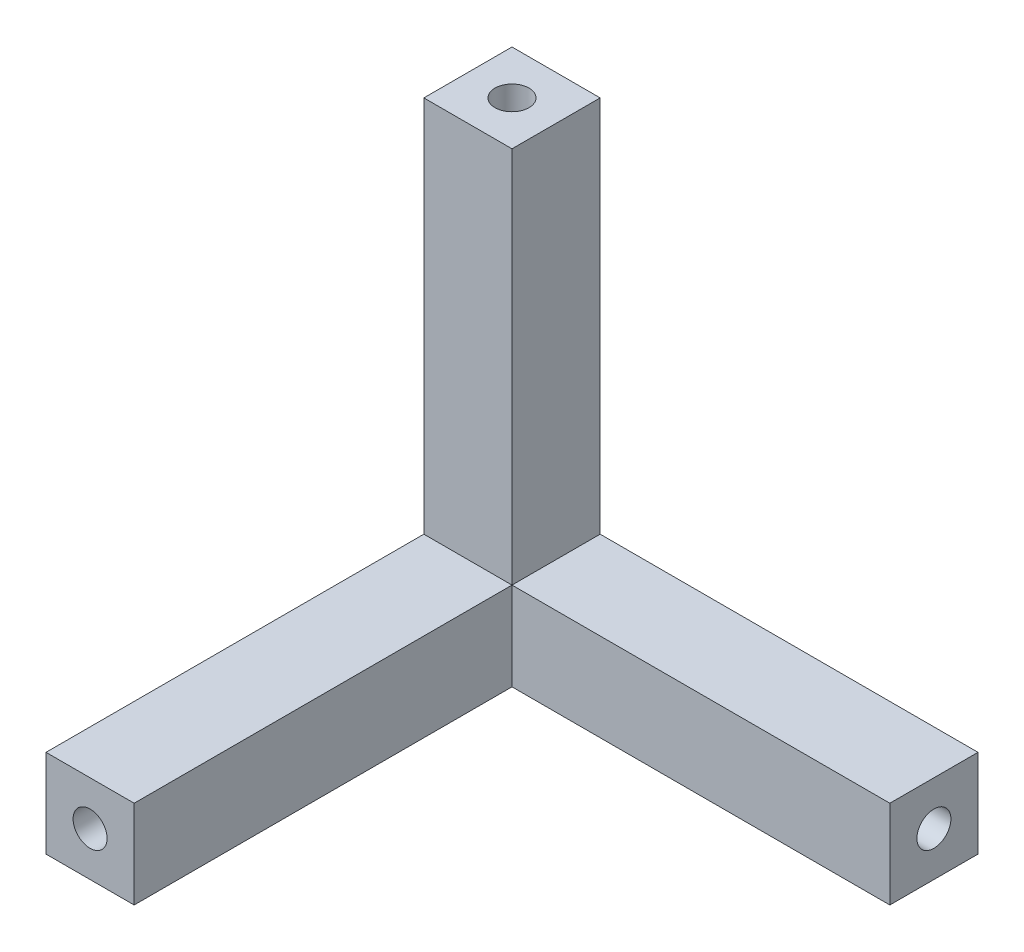
ISO-10303-21;
HEADER;
FILE_DESCRIPTION(('STEP AP214'),'2;1');
FILE_NAME('part.step','',(''),(''),'','','');
FILE_SCHEMA(('AUTOMOTIVE_DESIGN { 1 0 10303 214 1 1 1 1 }'));
ENDSEC;
DATA;
#1=APPLICATION_CONTEXT('core data for automotive mechanical design processes');
#2=APPLICATION_PROTOCOL_DEFINITION('international standard','automotive_design',2000,#1);
#3=PRODUCT_CONTEXT('',#1,'mechanical');
#4=PRODUCT('Part','Part','',(#3));
#5=PRODUCT_RELATED_PRODUCT_CATEGORY('part','',(#4));
#6=PRODUCT_DEFINITION_FORMATION('','',#4);
#7=PRODUCT_DEFINITION_CONTEXT('part definition',#1,'design');
#8=PRODUCT_DEFINITION('design','',#6,#7);
#9=PRODUCT_DEFINITION_SHAPE('','',#8);
#10=(LENGTH_UNIT() NAMED_UNIT(*) SI_UNIT(.MILLI.,.METRE.));
#11=(NAMED_UNIT(*) PLANE_ANGLE_UNIT() SI_UNIT($,.RADIAN.));
#12=(NAMED_UNIT(*) SI_UNIT($,.STERADIAN.) SOLID_ANGLE_UNIT());
#13=UNCERTAINTY_MEASURE_WITH_UNIT(LENGTH_MEASURE(1.E-05),#10,'distance_accuracy_value','');
#14=(GEOMETRIC_REPRESENTATION_CONTEXT(3) GLOBAL_UNCERTAINTY_ASSIGNED_CONTEXT((#13)) GLOBAL_UNIT_ASSIGNED_CONTEXT((#10,
#11,#12)) REPRESENTATION_CONTEXT('',''));
#15=CARTESIAN_POINT('',(0.,0.,0.));
#16=DIRECTION('',(0.,0.,1.));
#17=DIRECTION('',(1.,0.,0.));
#18=AXIS2_PLACEMENT_3D('',#15,#16,#17);
#19=CARTESIAN_POINT('',(0.,1.75,0.));
#20=DIRECTION('',(0.,-1.,0.));
#21=DIRECTION('',(0.,0.,-1.));
#22=AXIS2_PLACEMENT_3D('',#19,#20,#21);
#23=PLANE('',#22);
#24=DIRECTION('',(0.,0.,-1.));
#25=VECTOR('',#24,1.);
#26=CARTESIAN_POINT('',(1.75,1.75,1.75));
#27=LINE('',#26,#25);
#28=CARTESIAN_POINT('',(1.75,1.75,1.75));
#29=VERTEX_POINT('',#28);
#30=CARTESIAN_POINT('',(1.75,1.75,-1.75));
#31=VERTEX_POINT('',#30);
#32=EDGE_CURVE('E143',#29,#31,#27,.T.);
#33=ORIENTED_EDGE('',*,*,#32,.F.);
#34=DIRECTION('',(1.,0.,0.));
#35=VECTOR('',#34,1.);
#36=CARTESIAN_POINT('',(16.75,1.75,1.75));
#37=LINE('',#36,#35);
#38=CARTESIAN_POINT('',(16.75,1.75,1.75));
#39=VERTEX_POINT('',#38);
#40=EDGE_CURVE('E116',#29,#39,#37,.T.);
#41=ORIENTED_EDGE('',*,*,#40,.T.);
#42=DIRECTION('',(0.,0.,-1.));
#43=VECTOR('',#42,1.);
#44=CARTESIAN_POINT('',(16.75,1.75,-1.75));
#45=LINE('',#44,#43);
#46=CARTESIAN_POINT('',(16.75,1.75,-1.75));
#47=VERTEX_POINT('',#46);
#48=EDGE_CURVE('E125',#39,#47,#45,.T.);
#49=ORIENTED_EDGE('',*,*,#48,.T.);
#50=DIRECTION('',(-1.,0.,0.));
#51=VECTOR('',#50,1.);
#52=CARTESIAN_POINT('',(-1.75,1.75,-1.75));
#53=LINE('',#52,#51);
#54=EDGE_CURVE('E69',#47,#31,#53,.T.);
#55=ORIENTED_EDGE('',*,*,#54,.T.);
#56=EDGE_LOOP('',(#33,#41,#49,#55));
#57=FACE_BOUND('',#56,.T.);
#58=ADVANCED_FACE('F45',(#57),#23,.F.);
#59=DIRECTION('',(1.,0.,0.));
#60=VECTOR('',#59,1.);
#61=CARTESIAN_POINT('',(1.75,1.75,1.75));
#62=LINE('',#61,#60);
#63=CARTESIAN_POINT('',(-1.75,1.75,1.75));
#64=VERTEX_POINT('',#63);
#65=EDGE_CURVE('E61',#64,#29,#62,.T.);
#66=ORIENTED_EDGE('',*,*,#65,.F.);
#67=DIRECTION('',(0.,0.,1.));
#68=VECTOR('',#67,1.);
#69=CARTESIAN_POINT('',(-1.75,1.75,-1.75));
#70=LINE('',#69,#68);
#71=CARTESIAN_POINT('',(-1.75,1.75,16.75));
#72=VERTEX_POINT('',#71);
#73=EDGE_CURVE('E202',#64,#72,#70,.T.);
#74=ORIENTED_EDGE('',*,*,#73,.T.);
#75=DIRECTION('',(1.,0.,0.));
#76=VECTOR('',#75,1.);
#77=CARTESIAN_POINT('',(1.75,1.75,16.75));
#78=LINE('',#77,#76);
#79=CARTESIAN_POINT('',(1.75,1.75,16.75));
#80=VERTEX_POINT('',#79);
#81=EDGE_CURVE('E139',#72,#80,#78,.T.);
#82=ORIENTED_EDGE('',*,*,#81,.T.);
#83=DIRECTION('',(0.,0.,-1.));
#84=VECTOR('',#83,1.);
#85=CARTESIAN_POINT('',(1.75,1.75,1.75));
#86=LINE('',#85,#84);
#87=EDGE_CURVE('E126',#80,#29,#86,.T.);
#88=ORIENTED_EDGE('',*,*,#87,.T.);
#89=EDGE_LOOP('',(#66,#74,#82,#88));
#90=FACE_BOUND('',#89,.T.);
#91=ADVANCED_FACE('F137',(#90),#23,.F.);
#92=CARTESIAN_POINT('',(-1.75,1.75,-1.75));
#93=DIRECTION('',(0.,0.,1.));
#94=DIRECTION('',(1.,0.,0.));
#95=AXIS2_PLACEMENT_3D('',#92,#93,#94);
#96=PLANE('',#95);
#97=DIRECTION('',(-1.,0.,0.));
#98=VECTOR('',#97,1.);
#99=CARTESIAN_POINT('',(-1.75,-1.75,-1.75));
#100=LINE('',#99,#98);
#101=CARTESIAN_POINT('',(16.75,-1.75,-1.75));
#102=VERTEX_POINT('',#101);
#103=CARTESIAN_POINT('',(-1.75,-1.75,-1.75));
#104=VERTEX_POINT('',#103);
#105=EDGE_CURVE('E196',#102,#104,#100,.T.);
#106=ORIENTED_EDGE('',*,*,#105,.T.);
#107=DIRECTION('',(0.,-1.,0.));
#108=VECTOR('',#107,1.);
#109=CARTESIAN_POINT('',(-1.75,1.75,-1.75));
#110=LINE('',#109,#108);
#111=CARTESIAN_POINT('',(-1.75000000000004,16.75,-1.75000000000004));
#112=VERTEX_POINT('',#111);
#113=EDGE_CURVE('E12',#112,#104,#110,.T.);
#114=ORIENTED_EDGE('',*,*,#113,.F.);
#115=DIRECTION('',(-1.,0.,0.));
#116=VECTOR('',#115,1.);
#117=CARTESIAN_POINT('',(1.74999999999996,16.75,-1.75000000000004));
#118=LINE('',#117,#116);
#119=CARTESIAN_POINT('',(1.74999999999996,16.75,-1.75000000000004));
#120=VERTEX_POINT('',#119);
#121=EDGE_CURVE('E171',#120,#112,#118,.T.);
#122=ORIENTED_EDGE('',*,*,#121,.F.);
#123=DIRECTION('',(0.,1.,0.));
#124=VECTOR('',#123,1.);
#125=CARTESIAN_POINT('',(1.75,1.75,-1.75));
#126=LINE('',#125,#124);
#127=EDGE_CURVE('E167',#31,#120,#126,.T.);
#128=ORIENTED_EDGE('',*,*,#127,.F.);
#129=ORIENTED_EDGE('',*,*,#54,.F.);
#130=DIRECTION('',(0.,-1.,0.));
#131=VECTOR('',#130,1.);
#132=CARTESIAN_POINT('',(16.75,1.75,-1.75));
#133=LINE('',#132,#131);
#134=EDGE_CURVE('E210',#47,#102,#133,.T.);
#135=ORIENTED_EDGE('',*,*,#134,.T.);
#136=EDGE_LOOP('',(#106,#114,#122,#128,#129,#135));
#137=FACE_BOUND('',#136,.T.);
#138=ADVANCED_FACE('F47',(#137),#96,.F.);
#139=CARTESIAN_POINT('',(-1.75,1.75,-1.75));
#140=DIRECTION('',(1.,0.,0.));
#141=DIRECTION('',(0.,0.,-1.));
#142=AXIS2_PLACEMENT_3D('',#139,#140,#141);
#143=PLANE('',#142);
#144=DIRECTION('',(0.,0.,1.));
#145=VECTOR('',#144,1.);
#146=CARTESIAN_POINT('',(-1.75,-1.75,-1.75));
#147=LINE('',#146,#145);
#148=CARTESIAN_POINT('',(-1.75,-1.75,16.75));
#149=VERTEX_POINT('',#148);
#150=EDGE_CURVE('E214',#104,#149,#147,.T.);
#151=ORIENTED_EDGE('',*,*,#150,.T.);
#152=DIRECTION('',(0.,-1.,0.));
#153=VECTOR('',#152,1.);
#154=CARTESIAN_POINT('',(-1.75,1.75,16.75));
#155=LINE('',#154,#153);
#156=EDGE_CURVE('E54',#72,#149,#155,.T.);
#157=ORIENTED_EDGE('',*,*,#156,.F.);
#158=ORIENTED_EDGE('',*,*,#73,.F.);
#159=DIRECTION('',(0.,1.,0.));
#160=VECTOR('',#159,1.);
#161=CARTESIAN_POINT('',(-1.75,1.75,1.75));
#162=LINE('',#161,#160);
#163=CARTESIAN_POINT('',(-1.75000000000004,16.75,1.74999999999996));
#164=VERTEX_POINT('',#163);
#165=EDGE_CURVE('E158',#64,#164,#162,.T.);
#166=ORIENTED_EDGE('',*,*,#165,.T.);
#167=DIRECTION('',(0.,0.,1.));
#168=VECTOR('',#167,1.);
#169=CARTESIAN_POINT('',(-1.75000000000004,16.75,1.74999999999996));
#170=LINE('',#169,#168);
#171=EDGE_CURVE('E175',#112,#164,#170,.T.);
#172=ORIENTED_EDGE('',*,*,#171,.F.);
#173=ORIENTED_EDGE('',*,*,#113,.T.);
#174=EDGE_LOOP('',(#151,#157,#158,#166,#172,#173));
#175=FACE_BOUND('',#174,.T.);
#176=ADVANCED_FACE('F253',(#175),#143,.F.);
#177=CARTESIAN_POINT('',(1.75,1.75,16.75));
#178=DIRECTION('',(0.,0.,-1.));
#179=DIRECTION('',(-1.,0.,0.));
#180=AXIS2_PLACEMENT_3D('',#177,#178,#179);
#181=PLANE('',#180);
#182=CARTESIAN_POINT('',(0.,0.,16.75));
#183=DIRECTION('',(0.,0.,1.));
#184=DIRECTION('',(1.,0.,0.));
#185=AXIS2_PLACEMENT_3D('',#182,#183,#184);
#186=CIRCLE('',#185,0.675);
#187=CARTESIAN_POINT('',(0.675,0.,16.75));
#188=VERTEX_POINT('',#187);
#189=EDGE_CURVE('E188',#188,#188,#186,.T.);
#190=ORIENTED_EDGE('',*,*,#189,.F.);
#191=EDGE_LOOP('',(#190));
#192=FACE_BOUND('',#191,.T.);
#193=DIRECTION('',(1.,0.,0.));
#194=VECTOR('',#193,1.);
#195=CARTESIAN_POINT('',(1.75,-1.75,16.75));
#196=LINE('',#195,#194);
#197=CARTESIAN_POINT('',(1.75,-1.75,16.75));
#198=VERTEX_POINT('',#197);
#199=EDGE_CURVE('E217',#149,#198,#196,.T.);
#200=ORIENTED_EDGE('',*,*,#199,.T.);
#201=DIRECTION('',(0.,-1.,0.));
#202=VECTOR('',#201,1.);
#203=CARTESIAN_POINT('',(1.75,1.75,16.75));
#204=LINE('',#203,#202);
#205=EDGE_CURVE('E135',#80,#198,#204,.T.);
#206=ORIENTED_EDGE('',*,*,#205,.F.);
#207=ORIENTED_EDGE('',*,*,#81,.F.);
#208=ORIENTED_EDGE('',*,*,#156,.T.);
#209=EDGE_LOOP('',(#200,#206,#207,#208));
#210=FACE_BOUND('',#209,.T.);
#211=ADVANCED_FACE('F238',(#192,#210),#181,.F.);
#212=CARTESIAN_POINT('',(1.75,1.75,1.75));
#213=DIRECTION('',(-1.,0.,0.));
#214=DIRECTION('',(0.,0.,1.));
#215=AXIS2_PLACEMENT_3D('',#212,#213,#214);
#216=PLANE('',#215);
#217=DIRECTION('',(0.,0.,-1.));
#218=VECTOR('',#217,1.);
#219=CARTESIAN_POINT('',(1.75,-1.75,1.75));
#220=LINE('',#219,#218);
#221=CARTESIAN_POINT('',(1.75,-1.75,1.75));
#222=VERTEX_POINT('',#221);
#223=EDGE_CURVE('E133',#198,#222,#220,.T.);
#224=ORIENTED_EDGE('',*,*,#223,.T.);
#225=DIRECTION('',(0.,-1.,0.));
#226=VECTOR('',#225,1.);
#227=CARTESIAN_POINT('',(1.75,1.75,1.75));
#228=LINE('',#227,#226);
#229=EDGE_CURVE('E119',#29,#222,#228,.T.);
#230=ORIENTED_EDGE('',*,*,#229,.F.);
#231=ORIENTED_EDGE('',*,*,#87,.F.);
#232=ORIENTED_EDGE('',*,*,#205,.T.);
#233=EDGE_LOOP('',(#224,#230,#231,#232));
#234=FACE_BOUND('',#233,.T.);
#235=ADVANCED_FACE('F130',(#234),#216,.F.);
#236=CARTESIAN_POINT('',(16.75,1.75,1.75));
#237=DIRECTION('',(0.,0.,-1.));
#238=DIRECTION('',(-1.,0.,0.));
#239=AXIS2_PLACEMENT_3D('',#236,#237,#238);
#240=PLANE('',#239);
#241=DIRECTION('',(1.,0.,0.));
#242=VECTOR('',#241,1.);
#243=CARTESIAN_POINT('',(16.75,-1.75,1.75));
#244=LINE('',#243,#242);
#245=CARTESIAN_POINT('',(16.75,-1.75,1.75));
#246=VERTEX_POINT('',#245);
#247=EDGE_CURVE('E222',#222,#246,#244,.T.);
#248=ORIENTED_EDGE('',*,*,#247,.T.);
#249=DIRECTION('',(0.,-1.,0.));
#250=VECTOR('',#249,1.);
#251=CARTESIAN_POINT('',(16.75,1.75,1.75));
#252=LINE('',#251,#250);
#253=EDGE_CURVE('E122',#39,#246,#252,.T.);
#254=ORIENTED_EDGE('',*,*,#253,.F.);
#255=ORIENTED_EDGE('',*,*,#40,.F.);
#256=ORIENTED_EDGE('',*,*,#229,.T.);
#257=EDGE_LOOP('',(#248,#254,#255,#256));
#258=FACE_BOUND('',#257,.T.);
#259=ADVANCED_FACE('F118',(#258),#240,.F.);
#260=CARTESIAN_POINT('',(16.75,1.75,-1.75));
#261=DIRECTION('',(-1.,0.,0.));
#262=DIRECTION('',(0.,0.,1.));
#263=AXIS2_PLACEMENT_3D('',#260,#261,#262);
#264=PLANE('',#263);
#265=CARTESIAN_POINT('',(16.75,0.,0.));
#266=DIRECTION('',(1.,0.,0.));
#267=DIRECTION('',(0.,0.,-1.));
#268=AXIS2_PLACEMENT_3D('',#265,#266,#267);
#269=CIRCLE('',#268,0.675);
#270=CARTESIAN_POINT('',(16.75,0.,-0.675000000000017));
#271=VERTEX_POINT('',#270);
#272=EDGE_CURVE('E183',#271,#271,#269,.T.);
#273=ORIENTED_EDGE('',*,*,#272,.F.);
#274=EDGE_LOOP('',(#273));
#275=FACE_BOUND('',#274,.T.);
#276=DIRECTION('',(0.,0.,-1.));
#277=VECTOR('',#276,1.);
#278=CARTESIAN_POINT('',(16.75,-1.75,-1.75));
#279=LINE('',#278,#277);
#280=EDGE_CURVE('E203',#246,#102,#279,.T.);
#281=ORIENTED_EDGE('',*,*,#280,.T.);
#282=ORIENTED_EDGE('',*,*,#134,.F.);
#283=ORIENTED_EDGE('',*,*,#48,.F.);
#284=ORIENTED_EDGE('',*,*,#253,.T.);
#285=EDGE_LOOP('',(#281,#282,#283,#284));
#286=FACE_BOUND('',#285,.T.);
#287=ADVANCED_FACE('F245',(#275,#286),#264,.F.);
#288=CARTESIAN_POINT('',(0.,-1.75,0.));
#289=DIRECTION('',(0.,-1.,0.));
#290=DIRECTION('',(0.,0.,-1.));
#291=AXIS2_PLACEMENT_3D('',#288,#289,#290);
#292=PLANE('',#291);
#293=ORIENTED_EDGE('',*,*,#105,.F.);
#294=ORIENTED_EDGE('',*,*,#280,.F.);
#295=ORIENTED_EDGE('',*,*,#247,.F.);
#296=ORIENTED_EDGE('',*,*,#223,.F.);
#297=ORIENTED_EDGE('',*,*,#199,.F.);
#298=ORIENTED_EDGE('',*,*,#150,.F.);
#299=EDGE_LOOP('',(#293,#294,#295,#296,#297,#298));
#300=FACE_BOUND('',#299,.T.);
#301=ADVANCED_FACE('F242',(#300),#292,.T.);
#302=CARTESIAN_POINT('',(0.,0.,1.75000000000001));
#303=DIRECTION('',(0.,0.,1.));
#304=DIRECTION('',(1.,0.,0.));
#305=AXIS2_PLACEMENT_3D('',#302,#303,#304);
#306=CYLINDRICAL_SURFACE('',#305,0.675);
#307=CARTESIAN_POINT('',(0.,0.,1.75000000000001));
#308=DIRECTION('',(0.,0.,1.));
#309=DIRECTION('',(1.,0.,0.));
#310=AXIS2_PLACEMENT_3D('',#307,#308,#309);
#311=CIRCLE('',#310,0.675);
#312=CARTESIAN_POINT('',(0.675,0.,1.75000000000001));
#313=VERTEX_POINT('',#312);
#314=EDGE_CURVE('E192',#313,#313,#311,.T.);
#315=ORIENTED_EDGE('',*,*,#314,.F.);
#316=EDGE_LOOP('',(#315));
#317=FACE_BOUND('',#316,.T.);
#318=ORIENTED_EDGE('',*,*,#189,.T.);
#319=EDGE_LOOP('',(#318));
#320=FACE_BOUND('',#319,.T.);
#321=ADVANCED_FACE('F268',(#317,#320),#306,.F.);
#322=CARTESIAN_POINT('',(0.,0.,1.75000000000001));
#323=DIRECTION('',(0.,0.,1.));
#324=DIRECTION('',(1.,0.,0.));
#325=AXIS2_PLACEMENT_3D('',#322,#323,#324);
#326=PLANE('',#325);
#327=ORIENTED_EDGE('',*,*,#314,.T.);
#328=EDGE_LOOP('',(#327));
#329=FACE_BOUND('',#328,.T.);
#330=ADVANCED_FACE('F302',(#329),#326,.T.);
#331=CARTESIAN_POINT('',(1.75,0.,0.));
#332=DIRECTION('',(1.,0.,0.));
#333=DIRECTION('',(0.,0.,-1.));
#334=AXIS2_PLACEMENT_3D('',#331,#332,#333);
#335=CYLINDRICAL_SURFACE('',#334,0.675);
#336=CARTESIAN_POINT('',(1.75,0.,0.));
#337=DIRECTION('',(1.,0.,0.));
#338=DIRECTION('',(0.,0.,-1.));
#339=AXIS2_PLACEMENT_3D('',#336,#337,#338);
#340=CIRCLE('',#339,0.675);
#341=CARTESIAN_POINT('',(1.75,0.,-0.675000000000002));
#342=VERTEX_POINT('',#341);
#343=EDGE_CURVE('E184',#342,#342,#340,.T.);
#344=ORIENTED_EDGE('',*,*,#343,.F.);
#345=EDGE_LOOP('',(#344));
#346=FACE_BOUND('',#345,.T.);
#347=ORIENTED_EDGE('',*,*,#272,.T.);
#348=EDGE_LOOP('',(#347));
#349=FACE_BOUND('',#348,.T.);
#350=ADVANCED_FACE('F308',(#346,#349),#335,.F.);
#351=CARTESIAN_POINT('',(1.75,0.,0.));
#352=DIRECTION('',(1.,0.,0.));
#353=DIRECTION('',(0.,0.,-1.));
#354=AXIS2_PLACEMENT_3D('',#351,#352,#353);
#355=PLANE('',#354);
#356=ORIENTED_EDGE('',*,*,#343,.T.);
#357=EDGE_LOOP('',(#356));
#358=FACE_BOUND('',#357,.T.);
#359=ADVANCED_FACE('F314',(#358),#355,.T.);
#360=CARTESIAN_POINT('',(0.,16.75,0.));
#361=DIRECTION('',(0.,1.,0.));
#362=DIRECTION('',(0.,0.,1.));
#363=AXIS2_PLACEMENT_3D('',#360,#361,#362);
#364=PLANE('',#363);
#365=CARTESIAN_POINT('',(0.,16.75,0.));
#366=DIRECTION('',(0.,1.,0.));
#367=DIRECTION('',(0.,0.,1.));
#368=AXIS2_PLACEMENT_3D('',#365,#366,#367);
#369=CIRCLE('',#368,0.675);
#370=CARTESIAN_POINT('',(0.,16.75,0.674999999999959));
#371=VERTEX_POINT('',#370);
#372=EDGE_CURVE('E149',#371,#371,#369,.F.);
#373=ORIENTED_EDGE('',*,*,#372,.T.);
#374=EDGE_LOOP('',(#373));
#375=FACE_BOUND('',#374,.T.);
#376=DIRECTION('',(0.,0.,-1.));
#377=VECTOR('',#376,1.);
#378=CARTESIAN_POINT('',(1.74999999999996,16.75,1.74999999999996));
#379=LINE('',#378,#377);
#380=CARTESIAN_POINT('',(1.74999999999996,16.75,1.74999999999996));
#381=VERTEX_POINT('',#380);
#382=EDGE_CURVE('E163',#381,#120,#379,.T.);
#383=ORIENTED_EDGE('',*,*,#382,.T.);
#384=ORIENTED_EDGE('',*,*,#121,.T.);
#385=ORIENTED_EDGE('',*,*,#171,.T.);
#386=DIRECTION('',(1.,0.,0.));
#387=VECTOR('',#386,1.);
#388=CARTESIAN_POINT('',(1.74999999999996,16.75,1.74999999999996));
#389=LINE('',#388,#387);
#390=EDGE_CURVE('E179',#164,#381,#389,.T.);
#391=ORIENTED_EDGE('',*,*,#390,.T.);
#392=EDGE_LOOP('',(#383,#384,#385,#391));
#393=FACE_BOUND('',#392,.T.);
#394=ADVANCED_FACE('F252',(#375,#393),#364,.T.);
#395=CARTESIAN_POINT('',(1.75,1.75,1.75));
#396=DIRECTION('',(1.,0.,0.));
#397=DIRECTION('',(0.,1.,0.));
#398=AXIS2_PLACEMENT_3D('',#395,#396,#397);
#399=PLANE('',#398);
#400=ORIENTED_EDGE('',*,*,#127,.T.);
#401=ORIENTED_EDGE('',*,*,#382,.F.);
#402=DIRECTION('',(0.,1.,0.));
#403=VECTOR('',#402,1.);
#404=CARTESIAN_POINT('',(1.75,1.75,1.75));
#405=LINE('',#404,#403);
#406=EDGE_CURVE('E156',#29,#381,#405,.T.);
#407=ORIENTED_EDGE('',*,*,#406,.F.);
#408=ORIENTED_EDGE('',*,*,#32,.T.);
#409=EDGE_LOOP('',(#400,#401,#407,#408));
#410=FACE_BOUND('',#409,.T.);
#411=ADVANCED_FACE('F162',(#410),#399,.T.);
#412=CARTESIAN_POINT('',(1.75,1.75,1.75));
#413=DIRECTION('',(0.,0.,1.));
#414=DIRECTION('',(0.,-1.,0.));
#415=AXIS2_PLACEMENT_3D('',#412,#413,#414);
#416=PLANE('',#415);
#417=ORIENTED_EDGE('',*,*,#390,.F.);
#418=ORIENTED_EDGE('',*,*,#165,.F.);
#419=ORIENTED_EDGE('',*,*,#65,.T.);
#420=ORIENTED_EDGE('',*,*,#406,.T.);
#421=EDGE_LOOP('',(#417,#418,#419,#420));
#422=FACE_BOUND('',#421,.T.);
#423=ADVANCED_FACE('F155',(#422),#416,.T.);
#424=CARTESIAN_POINT('',(0.,1.75,0.));
#425=DIRECTION('',(0.,1.,0.));
#426=DIRECTION('',(-1.,0.,0.));
#427=AXIS2_PLACEMENT_3D('',#424,#425,#426);
#428=PLANE('',#427);
#429=CARTESIAN_POINT('',(0.,1.75,0.));
#430=DIRECTION('',(0.,1.,0.));
#431=DIRECTION('',(-1.,0.,0.));
#432=AXIS2_PLACEMENT_3D('',#429,#430,#431);
#433=CIRCLE('',#432,0.675);
#434=CARTESIAN_POINT('',(-0.675000000000001,1.75,0.));
#435=VERTEX_POINT('',#434);
#436=EDGE_CURVE('E419',#435,#435,#433,.T.);
#437=ORIENTED_EDGE('',*,*,#436,.T.);
#438=EDGE_LOOP('',(#437));
#439=FACE_BOUND('',#438,.T.);
#440=ADVANCED_FACE('F331',(#439),#428,.T.);
#441=CARTESIAN_POINT('',(0.,1.75,0.));
#442=DIRECTION('',(0.,1.,0.));
#443=DIRECTION('',(-1.,0.,0.));
#444=AXIS2_PLACEMENT_3D('',#441,#442,#443);
#445=CYLINDRICAL_SURFACE('',#444,0.675);
#446=ORIENTED_EDGE('',*,*,#436,.F.);
#447=EDGE_LOOP('',(#446));
#448=FACE_BOUND('',#447,.T.);
#449=ORIENTED_EDGE('',*,*,#372,.F.);
#450=EDGE_LOOP('',(#449));
#451=FACE_BOUND('',#450,.T.);
#452=ADVANCED_FACE('F349',(#448,#451),#445,.F.);
#453=CLOSED_SHELL('',(#58,#91,#138,#176,#211,#235,#259,#287,#301,#321,#330,#350,#359,#394,#411,
#423,#440,#452));
#454=MANIFOLD_SOLID_BREP('B2',#453);
#455=ADVANCED_BREP_SHAPE_REPRESENTATION('',(#18,#454),#14);
#456=SHAPE_DEFINITION_REPRESENTATION(#9,#455);
ENDSEC;
END-ISO-10303-21;
